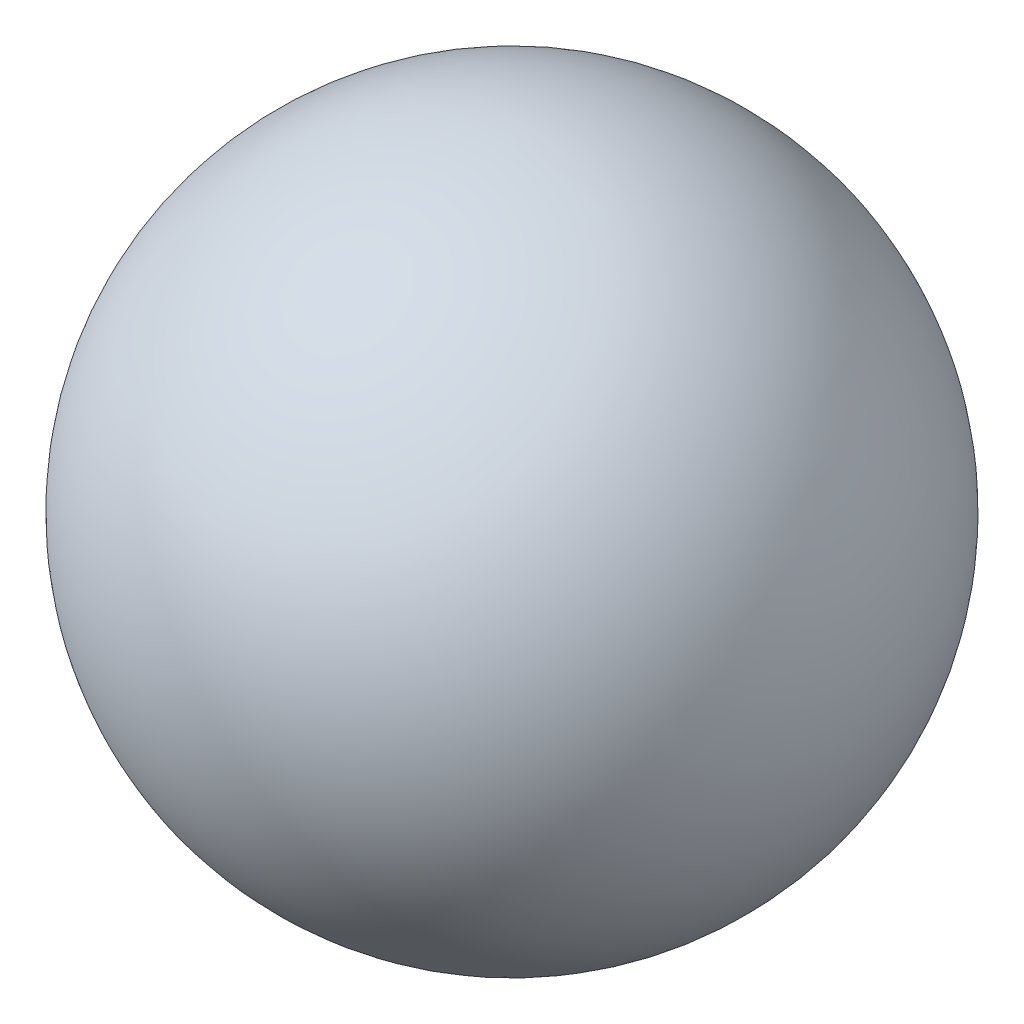
ISO-10303-21;
HEADER;
FILE_DESCRIPTION(('STEP AP214'),'2;1');
FILE_NAME('part.step','',(''),(''),'','','');
FILE_SCHEMA(('AUTOMOTIVE_DESIGN { 1 0 10303 214 1 1 1 1 }'));
ENDSEC;
DATA;
#1=APPLICATION_CONTEXT('core data for automotive mechanical design processes');
#2=APPLICATION_PROTOCOL_DEFINITION('international standard','automotive_design',2000,#1);
#3=PRODUCT_CONTEXT('',#1,'mechanical');
#4=PRODUCT('Part','Part','',(#3));
#5=PRODUCT_RELATED_PRODUCT_CATEGORY('part','',(#4));
#6=PRODUCT_DEFINITION_FORMATION('','',#4);
#7=PRODUCT_DEFINITION_CONTEXT('part definition',#1,'design');
#8=PRODUCT_DEFINITION('design','',#6,#7);
#9=PRODUCT_DEFINITION_SHAPE('','',#8);
#10=(LENGTH_UNIT() NAMED_UNIT(*) SI_UNIT(.MILLI.,.METRE.));
#11=(NAMED_UNIT(*) PLANE_ANGLE_UNIT() SI_UNIT($,.RADIAN.));
#12=(NAMED_UNIT(*) SI_UNIT($,.STERADIAN.) SOLID_ANGLE_UNIT());
#13=UNCERTAINTY_MEASURE_WITH_UNIT(LENGTH_MEASURE(1.E-05),#10,'distance_accuracy_value','');
#14=(GEOMETRIC_REPRESENTATION_CONTEXT(3) GLOBAL_UNCERTAINTY_ASSIGNED_CONTEXT((#13)) GLOBAL_UNIT_ASSIGNED_CONTEXT((#10,
#11,#12)) REPRESENTATION_CONTEXT('',''));
#15=CARTESIAN_POINT('',(0.,0.,0.));
#16=DIRECTION('',(0.,0.,1.));
#17=DIRECTION('',(1.,0.,0.));
#18=AXIS2_PLACEMENT_3D('',#15,#16,#17);
#19=CARTESIAN_POINT('',(0.,0.,0.));
#20=DIRECTION('',(0.,0.,-1.));
#21=DIRECTION('',(1.,0.,0.));
#22=AXIS2_PLACEMENT_3D('',#19,#20,#21);
#23=SPHERICAL_SURFACE('',#22,76.2);
#24=CARTESIAN_POINT('',(0.,0.,-76.2));
#25=VERTEX_POINT('',#24);
#26=VERTEX_LOOP('',#25);
#27=FACE_BOUND('',#26,.T.);
#28=ADVANCED_FACE('F41',(#27),#23,.T.);
#29=CLOSED_SHELL('',(#28));
#30=MANIFOLD_SOLID_BREP('B2',#29);
#31=ADVANCED_BREP_SHAPE_REPRESENTATION('',(#18,#30),#14);
#32=SHAPE_DEFINITION_REPRESENTATION(#9,#31);
ENDSEC;
END-ISO-10303-21;
